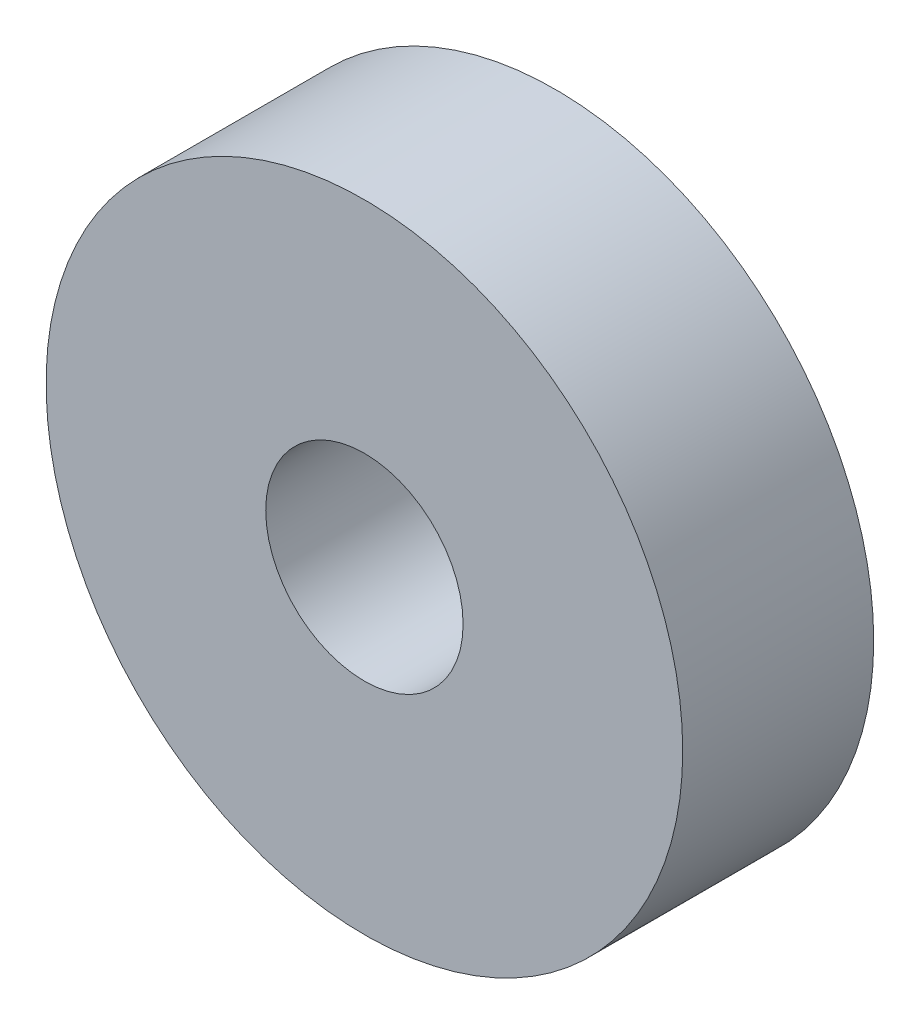
ISO-10303-21;
HEADER;
FILE_DESCRIPTION(('STEP AP214'),'2;1');
FILE_NAME('part.step','',(''),(''),'','','');
FILE_SCHEMA(('AUTOMOTIVE_DESIGN { 1 0 10303 214 1 1 1 1 }'));
ENDSEC;
DATA;
#1=APPLICATION_CONTEXT('core data for automotive mechanical design processes');
#2=APPLICATION_PROTOCOL_DEFINITION('international standard','automotive_design',2000,#1);
#3=PRODUCT_CONTEXT('',#1,'mechanical');
#4=PRODUCT('Part','Part','',(#3));
#5=PRODUCT_RELATED_PRODUCT_CATEGORY('part','',(#4));
#6=PRODUCT_DEFINITION_FORMATION('','',#4);
#7=PRODUCT_DEFINITION_CONTEXT('part definition',#1,'design');
#8=PRODUCT_DEFINITION('design','',#6,#7);
#9=PRODUCT_DEFINITION_SHAPE('','',#8);
#10=(LENGTH_UNIT() NAMED_UNIT(*) SI_UNIT(.MILLI.,.METRE.));
#11=(NAMED_UNIT(*) PLANE_ANGLE_UNIT() SI_UNIT($,.RADIAN.));
#12=(NAMED_UNIT(*) SI_UNIT($,.STERADIAN.) SOLID_ANGLE_UNIT());
#13=UNCERTAINTY_MEASURE_WITH_UNIT(LENGTH_MEASURE(1.E-05),#10,'distance_accuracy_value','');
#14=(GEOMETRIC_REPRESENTATION_CONTEXT(3) GLOBAL_UNCERTAINTY_ASSIGNED_CONTEXT((#13)) GLOBAL_UNIT_ASSIGNED_CONTEXT((#10,
#11,#12)) REPRESENTATION_CONTEXT('',''));
#15=CARTESIAN_POINT('',(0.,0.,0.));
#16=DIRECTION('',(0.,0.,1.));
#17=DIRECTION('',(1.,0.,0.));
#18=AXIS2_PLACEMENT_3D('',#15,#16,#17);
#19=CARTESIAN_POINT('',(41.999999999,46.,3.));
#20=DIRECTION('',(0.,0.,1.));
#21=DIRECTION('',(1.,0.,0.));
#22=AXIS2_PLACEMENT_3D('',#19,#20,#21);
#23=PLANE('',#22);
#24=CARTESIAN_POINT('',(41.999999999,46.,3.));
#25=DIRECTION('',(0.,0.,1.));
#26=DIRECTION('',(1.,0.,0.));
#27=AXIS2_PLACEMENT_3D('',#24,#25,#26);
#28=CIRCLE('',#27,5.00000000099992);
#29=CARTESIAN_POINT('',(46.9999999999999,46.,3.));
#30=VERTEX_POINT('',#29);
#31=EDGE_CURVE('E10',#30,#30,#28,.T.);
#32=ORIENTED_EDGE('',*,*,#31,.T.);
#33=EDGE_LOOP('',(#32));
#34=FACE_BOUND('',#33,.T.);
#35=CARTESIAN_POINT('',(41.999999999,46.,3.));
#36=DIRECTION('',(0.,0.,1.));
#37=DIRECTION('',(1.,0.,0.));
#38=AXIS2_PLACEMENT_3D('',#35,#36,#37);
#39=CIRCLE('',#38,1.54999999999996);
#40=CARTESIAN_POINT('',(43.549999999,46.,3.));
#41=VERTEX_POINT('',#40);
#42=EDGE_CURVE('E42',#41,#41,#39,.T.);
#43=ORIENTED_EDGE('',*,*,#42,.F.);
#44=EDGE_LOOP('',(#43));
#45=FACE_BOUND('',#44,.T.);
#46=ADVANCED_FACE('F31',(#34,#45),#23,.T.);
#47=CARTESIAN_POINT('',(41.999999999,46.,0.));
#48=DIRECTION('',(0.,0.,1.));
#49=DIRECTION('',(1.,0.,0.));
#50=AXIS2_PLACEMENT_3D('',#47,#48,#49);
#51=PLANE('',#50);
#52=CARTESIAN_POINT('',(41.999999999,46.,0.));
#53=DIRECTION('',(0.,0.,1.));
#54=DIRECTION('',(1.,0.,0.));
#55=AXIS2_PLACEMENT_3D('',#52,#53,#54);
#56=CIRCLE('',#55,5.00000000099992);
#57=CARTESIAN_POINT('',(46.9999999999999,46.,0.));
#58=VERTEX_POINT('',#57);
#59=EDGE_CURVE('E35',#58,#58,#56,.T.);
#60=ORIENTED_EDGE('',*,*,#59,.F.);
#61=EDGE_LOOP('',(#60));
#62=FACE_BOUND('',#61,.T.);
#63=CARTESIAN_POINT('',(41.999999999,46.,0.));
#64=DIRECTION('',(0.,0.,1.));
#65=DIRECTION('',(1.,0.,0.));
#66=AXIS2_PLACEMENT_3D('',#63,#64,#65);
#67=CIRCLE('',#66,1.54999999999996);
#68=CARTESIAN_POINT('',(43.549999999,46.,0.));
#69=VERTEX_POINT('',#68);
#70=EDGE_CURVE('E44',#69,#69,#67,.T.);
#71=ORIENTED_EDGE('',*,*,#70,.T.);
#72=EDGE_LOOP('',(#71));
#73=FACE_BOUND('',#72,.T.);
#74=ADVANCED_FACE('F54',(#62,#73),#51,.F.);
#75=CARTESIAN_POINT('',(41.999999999,46.,3.));
#76=DIRECTION('',(0.,0.,-1.));
#77=DIRECTION('',(-1.,0.,0.));
#78=AXIS2_PLACEMENT_3D('',#75,#76,#77);
#79=CYLINDRICAL_SURFACE('',#78,5.00000000099992);
#80=ORIENTED_EDGE('',*,*,#31,.F.);
#81=EDGE_LOOP('',(#80));
#82=FACE_BOUND('',#81,.T.);
#83=ORIENTED_EDGE('',*,*,#59,.T.);
#84=EDGE_LOOP('',(#83));
#85=FACE_BOUND('',#84,.T.);
#86=ADVANCED_FACE('F33',(#82,#85),#79,.T.);
#87=CARTESIAN_POINT('',(41.999999999,46.,3.));
#88=DIRECTION('',(0.,0.,-1.));
#89=DIRECTION('',(-1.,0.,0.));
#90=AXIS2_PLACEMENT_3D('',#87,#88,#89);
#91=CYLINDRICAL_SURFACE('',#90,1.54999999999996);
#92=ORIENTED_EDGE('',*,*,#42,.T.);
#93=EDGE_LOOP('',(#92));
#94=FACE_BOUND('',#93,.T.);
#95=ORIENTED_EDGE('',*,*,#70,.F.);
#96=EDGE_LOOP('',(#95));
#97=FACE_BOUND('',#96,.T.);
#98=ADVANCED_FACE('F50',(#94,#97),#91,.F.);
#99=CLOSED_SHELL('',(#46,#74,#86,#98));
#100=MANIFOLD_SOLID_BREP('B2',#99);
#101=ADVANCED_BREP_SHAPE_REPRESENTATION('',(#18,#100),#14);
#102=SHAPE_DEFINITION_REPRESENTATION(#9,#101);
ENDSEC;
END-ISO-10303-21;
